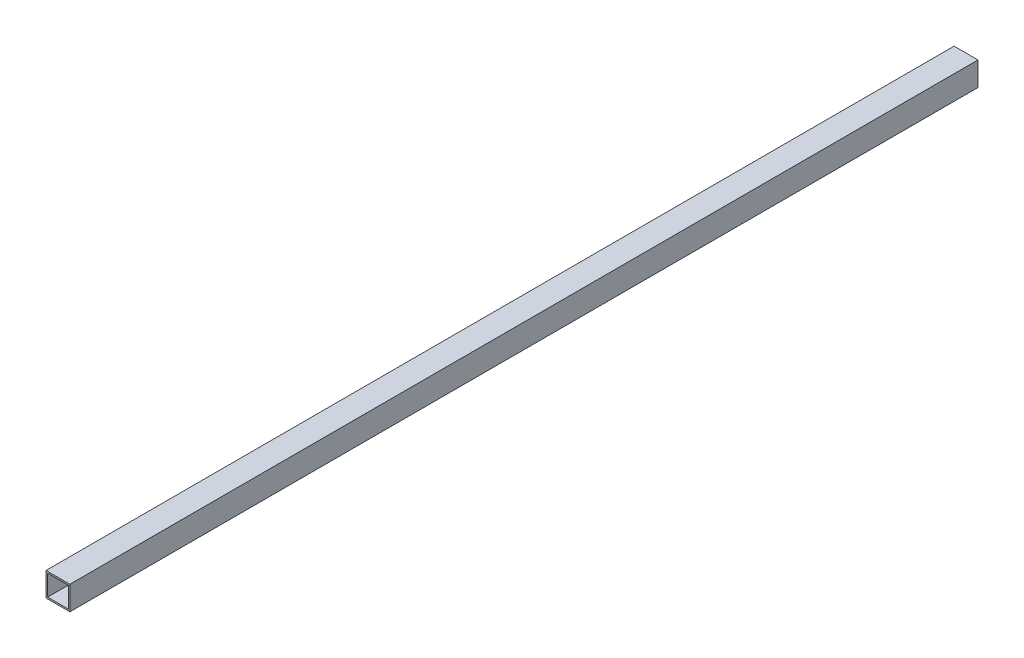
ISO-10303-21;
HEADER;
FILE_DESCRIPTION(('STEP AP214'),'2;1');
FILE_NAME('part.step','',(''),(''),'','','');
FILE_SCHEMA(('AUTOMOTIVE_DESIGN { 1 0 10303 214 1 1 1 1 }'));
ENDSEC;
DATA;
#1=APPLICATION_CONTEXT('core data for automotive mechanical design processes');
#2=APPLICATION_PROTOCOL_DEFINITION('international standard','automotive_design',2000,#1);
#3=PRODUCT_CONTEXT('',#1,'mechanical');
#4=PRODUCT('Part','Part','',(#3));
#5=PRODUCT_RELATED_PRODUCT_CATEGORY('part','',(#4));
#6=PRODUCT_DEFINITION_FORMATION('','',#4);
#7=PRODUCT_DEFINITION_CONTEXT('part definition',#1,'design');
#8=PRODUCT_DEFINITION('design','',#6,#7);
#9=PRODUCT_DEFINITION_SHAPE('','',#8);
#10=(LENGTH_UNIT() NAMED_UNIT(*) SI_UNIT(.MILLI.,.METRE.));
#11=(NAMED_UNIT(*) PLANE_ANGLE_UNIT() SI_UNIT($,.RADIAN.));
#12=(NAMED_UNIT(*) SI_UNIT($,.STERADIAN.) SOLID_ANGLE_UNIT());
#13=UNCERTAINTY_MEASURE_WITH_UNIT(LENGTH_MEASURE(1.E-05),#10,'distance_accuracy_value','');
#14=(GEOMETRIC_REPRESENTATION_CONTEXT(3) GLOBAL_UNCERTAINTY_ASSIGNED_CONTEXT((#13)) GLOBAL_UNIT_ASSIGNED_CONTEXT((#10,
#11,#12)) REPRESENTATION_CONTEXT('',''));
#15=CARTESIAN_POINT('',(0.,0.,0.));
#16=DIRECTION('',(0.,0.,1.));
#17=DIRECTION('',(1.,0.,0.));
#18=AXIS2_PLACEMENT_3D('',#15,#16,#17);
#19=CARTESIAN_POINT('',(-30.,30.,1140.));
#20=DIRECTION('',(1.,0.,0.));
#21=DIRECTION('',(0.,0.,-1.));
#22=AXIS2_PLACEMENT_3D('',#19,#20,#21);
#23=PLANE('',#22);
#24=DIRECTION('',(0.,0.,-1.));
#25=VECTOR('',#24,1.);
#26=CARTESIAN_POINT('',(-30.,-30.,1140.));
#27=LINE('',#26,#25);
#28=CARTESIAN_POINT('',(-30.,-30.,1140.));
#29=VERTEX_POINT('',#28);
#30=CARTESIAN_POINT('',(-30.,-30.,-1140.));
#31=VERTEX_POINT('',#30);
#32=EDGE_CURVE('E96',#29,#31,#27,.T.);
#33=ORIENTED_EDGE('',*,*,#32,.F.);
#34=DIRECTION('',(0.,-1.,0.));
#35=VECTOR('',#34,1.);
#36=CARTESIAN_POINT('',(-30.,30.,1140.));
#37=LINE('',#36,#35);
#38=CARTESIAN_POINT('',(-30.,30.,1140.));
#39=VERTEX_POINT('',#38);
#40=EDGE_CURVE('E85',#39,#29,#37,.T.);
#41=ORIENTED_EDGE('',*,*,#40,.F.);
#42=DIRECTION('',(0.,0.,-1.));
#43=VECTOR('',#42,1.);
#44=CARTESIAN_POINT('',(-30.,30.,1140.));
#45=LINE('',#44,#43);
#46=CARTESIAN_POINT('',(-30.,30.,-1140.));
#47=VERTEX_POINT('',#46);
#48=EDGE_CURVE('E101',#39,#47,#45,.T.);
#49=ORIENTED_EDGE('',*,*,#48,.T.);
#50=DIRECTION('',(0.,-1.,0.));
#51=VECTOR('',#50,1.);
#52=CARTESIAN_POINT('',(-30.,30.,-1140.));
#53=LINE('',#52,#51);
#54=EDGE_CURVE('E97',#47,#31,#53,.T.);
#55=ORIENTED_EDGE('',*,*,#54,.T.);
#56=EDGE_LOOP('',(#33,#41,#49,#55));
#57=FACE_BOUND('',#56,.T.);
#58=ADVANCED_FACE('F33',(#57),#23,.F.);
#59=CARTESIAN_POINT('',(-30.,-30.,1140.));
#60=DIRECTION('',(0.,1.,0.));
#61=DIRECTION('',(0.,0.,1.));
#62=AXIS2_PLACEMENT_3D('',#59,#60,#61);
#63=PLANE('',#62);
#64=DIRECTION('',(0.,0.,-1.));
#65=VECTOR('',#64,1.);
#66=CARTESIAN_POINT('',(30.,-30.,1140.));
#67=LINE('',#66,#65);
#68=CARTESIAN_POINT('',(30.,-30.,1140.));
#69=VERTEX_POINT('',#68);
#70=CARTESIAN_POINT('',(30.,-30.,-1140.));
#71=VERTEX_POINT('',#70);
#72=EDGE_CURVE('E100',#69,#71,#67,.T.);
#73=ORIENTED_EDGE('',*,*,#72,.F.);
#74=DIRECTION('',(1.,0.,0.));
#75=VECTOR('',#74,1.);
#76=CARTESIAN_POINT('',(-30.,-30.,1140.));
#77=LINE('',#76,#75);
#78=EDGE_CURVE('E82',#29,#69,#77,.T.);
#79=ORIENTED_EDGE('',*,*,#78,.F.);
#80=ORIENTED_EDGE('',*,*,#32,.T.);
#81=DIRECTION('',(1.,0.,0.));
#82=VECTOR('',#81,1.);
#83=CARTESIAN_POINT('',(-30.,-30.,-1140.));
#84=LINE('',#83,#82);
#85=EDGE_CURVE('E123',#31,#71,#84,.T.);
#86=ORIENTED_EDGE('',*,*,#85,.T.);
#87=EDGE_LOOP('',(#73,#79,#80,#86));
#88=FACE_BOUND('',#87,.T.);
#89=ADVANCED_FACE('F103',(#88),#63,.F.);
#90=CARTESIAN_POINT('',(30.,30.,1140.));
#91=DIRECTION('',(-1.,0.,0.));
#92=DIRECTION('',(0.,0.,1.));
#93=AXIS2_PLACEMENT_3D('',#90,#91,#92);
#94=PLANE('',#93);
#95=DIRECTION('',(0.,0.,-1.));
#96=VECTOR('',#95,1.);
#97=CARTESIAN_POINT('',(30.,30.,1140.));
#98=LINE('',#97,#96);
#99=CARTESIAN_POINT('',(30.,30.,1140.));
#100=VERTEX_POINT('',#99);
#101=CARTESIAN_POINT('',(30.,30.,-1140.));
#102=VERTEX_POINT('',#101);
#103=EDGE_CURVE('E37',#100,#102,#98,.T.);
#104=ORIENTED_EDGE('',*,*,#103,.F.);
#105=DIRECTION('',(0.,1.,0.));
#106=VECTOR('',#105,1.);
#107=CARTESIAN_POINT('',(30.,30.,1140.));
#108=LINE('',#107,#106);
#109=EDGE_CURVE('E106',#69,#100,#108,.T.);
#110=ORIENTED_EDGE('',*,*,#109,.F.);
#111=ORIENTED_EDGE('',*,*,#72,.T.);
#112=DIRECTION('',(0.,1.,0.));
#113=VECTOR('',#112,1.);
#114=CARTESIAN_POINT('',(30.,30.,-1140.));
#115=LINE('',#114,#113);
#116=EDGE_CURVE('E110',#71,#102,#115,.T.);
#117=ORIENTED_EDGE('',*,*,#116,.T.);
#118=EDGE_LOOP('',(#104,#110,#111,#117));
#119=FACE_BOUND('',#118,.T.);
#120=ADVANCED_FACE('F121',(#119),#94,.F.);
#121=CARTESIAN_POINT('',(-30.,30.,1140.));
#122=DIRECTION('',(0.,-1.,0.));
#123=DIRECTION('',(0.,0.,-1.));
#124=AXIS2_PLACEMENT_3D('',#121,#122,#123);
#125=PLANE('',#124);
#126=DIRECTION('',(-1.,0.,0.));
#127=VECTOR('',#126,1.);
#128=CARTESIAN_POINT('',(-30.,30.,-1140.));
#129=LINE('',#128,#127);
#130=EDGE_CURVE('E120',#102,#47,#129,.T.);
#131=ORIENTED_EDGE('',*,*,#130,.T.);
#132=ORIENTED_EDGE('',*,*,#48,.F.);
#133=DIRECTION('',(-1.,0.,0.));
#134=VECTOR('',#133,1.);
#135=CARTESIAN_POINT('',(-30.,30.,1140.));
#136=LINE('',#135,#134);
#137=EDGE_CURVE('E89',#100,#39,#136,.T.);
#138=ORIENTED_EDGE('',*,*,#137,.F.);
#139=ORIENTED_EDGE('',*,*,#103,.T.);
#140=EDGE_LOOP('',(#131,#132,#138,#139));
#141=FACE_BOUND('',#140,.T.);
#142=ADVANCED_FACE('F35',(#141),#125,.F.);
#143=CARTESIAN_POINT('',(0.,0.,1140.));
#144=DIRECTION('',(0.,0.,1.));
#145=DIRECTION('',(1.,0.,0.));
#146=AXIS2_PLACEMENT_3D('',#143,#144,#145);
#147=PLANE('',#146);
#148=DIRECTION('',(0.,-1.,0.));
#149=VECTOR('',#148,1.);
#150=CARTESIAN_POINT('',(-26.,26.,1140.));
#151=LINE('',#150,#149);
#152=CARTESIAN_POINT('',(-26.,-26.,1140.));
#153=VERTEX_POINT('',#152);
#154=CARTESIAN_POINT('',(-26.,26.,1140.));
#155=VERTEX_POINT('',#154);
#156=EDGE_CURVE('E128',#153,#155,#151,.F.);
#157=ORIENTED_EDGE('',*,*,#156,.T.);
#158=DIRECTION('',(-1.,0.,0.));
#159=VECTOR('',#158,1.);
#160=CARTESIAN_POINT('',(-26.,26.,1140.));
#161=LINE('',#160,#159);
#162=CARTESIAN_POINT('',(26.,26.,1140.));
#163=VERTEX_POINT('',#162);
#164=EDGE_CURVE('E124',#155,#163,#161,.F.);
#165=ORIENTED_EDGE('',*,*,#164,.T.);
#166=DIRECTION('',(0.,1.,0.));
#167=VECTOR('',#166,1.);
#168=CARTESIAN_POINT('',(26.,26.,1140.));
#169=LINE('',#168,#167);
#170=CARTESIAN_POINT('',(26.,-26.,1140.));
#171=VERTEX_POINT('',#170);
#172=EDGE_CURVE('E142',#163,#171,#169,.F.);
#173=ORIENTED_EDGE('',*,*,#172,.T.);
#174=DIRECTION('',(1.,0.,0.));
#175=VECTOR('',#174,1.);
#176=CARTESIAN_POINT('',(-26.,-26.,1140.));
#177=LINE('',#176,#175);
#178=EDGE_CURVE('E132',#171,#153,#177,.F.);
#179=ORIENTED_EDGE('',*,*,#178,.T.);
#180=EDGE_LOOP('',(#157,#165,#173,#179));
#181=FACE_BOUND('',#180,.T.);
#182=ORIENTED_EDGE('',*,*,#40,.T.);
#183=ORIENTED_EDGE('',*,*,#78,.T.);
#184=ORIENTED_EDGE('',*,*,#109,.T.);
#185=ORIENTED_EDGE('',*,*,#137,.T.);
#186=EDGE_LOOP('',(#182,#183,#184,#185));
#187=FACE_BOUND('',#186,.T.);
#188=ADVANCED_FACE('F87',(#181,#187),#147,.T.);
#189=CARTESIAN_POINT('',(0.,0.,-1140.));
#190=DIRECTION('',(0.,0.,1.));
#191=DIRECTION('',(1.,0.,0.));
#192=AXIS2_PLACEMENT_3D('',#189,#190,#191);
#193=PLANE('',#192);
#194=DIRECTION('',(0.,-1.,0.));
#195=VECTOR('',#194,1.);
#196=CARTESIAN_POINT('',(-26.,26.,-1140.));
#197=LINE('',#196,#195);
#198=CARTESIAN_POINT('',(-26.,-26.,-1140.));
#199=VERTEX_POINT('',#198);
#200=CARTESIAN_POINT('',(-26.,26.,-1140.));
#201=VERTEX_POINT('',#200);
#202=EDGE_CURVE('E11',#199,#201,#197,.F.);
#203=ORIENTED_EDGE('',*,*,#202,.F.);
#204=DIRECTION('',(1.,0.,0.));
#205=VECTOR('',#204,1.);
#206=CARTESIAN_POINT('',(-26.,-26.,-1140.));
#207=LINE('',#206,#205);
#208=CARTESIAN_POINT('',(26.,-26.,-1140.));
#209=VERTEX_POINT('',#208);
#210=EDGE_CURVE('E43',#209,#199,#207,.F.);
#211=ORIENTED_EDGE('',*,*,#210,.F.);
#212=DIRECTION('',(0.,1.,0.));
#213=VECTOR('',#212,1.);
#214=CARTESIAN_POINT('',(26.,26.,-1140.));
#215=LINE('',#214,#213);
#216=CARTESIAN_POINT('',(26.,26.,-1140.));
#217=VERTEX_POINT('',#216);
#218=EDGE_CURVE('E139',#217,#209,#215,.F.);
#219=ORIENTED_EDGE('',*,*,#218,.F.);
#220=DIRECTION('',(-1.,0.,0.));
#221=VECTOR('',#220,1.);
#222=CARTESIAN_POINT('',(-26.,26.,-1140.));
#223=LINE('',#222,#221);
#224=EDGE_CURVE('E136',#201,#217,#223,.F.);
#225=ORIENTED_EDGE('',*,*,#224,.F.);
#226=EDGE_LOOP('',(#203,#211,#219,#225));
#227=FACE_BOUND('',#226,.T.);
#228=ORIENTED_EDGE('',*,*,#54,.F.);
#229=ORIENTED_EDGE('',*,*,#130,.F.);
#230=ORIENTED_EDGE('',*,*,#116,.F.);
#231=ORIENTED_EDGE('',*,*,#85,.F.);
#232=EDGE_LOOP('',(#228,#229,#230,#231));
#233=FACE_BOUND('',#232,.T.);
#234=ADVANCED_FACE('F189',(#227,#233),#193,.F.);
#235=CARTESIAN_POINT('',(-26.,26.,1140.));
#236=DIRECTION('',(0.,1.,0.));
#237=DIRECTION('',(0.,0.,1.));
#238=AXIS2_PLACEMENT_3D('',#235,#236,#237);
#239=PLANE('',#238);
#240=DIRECTION('',(0.,0.,-1.));
#241=VECTOR('',#240,1.);
#242=CARTESIAN_POINT('',(26.,26.,1140.));
#243=LINE('',#242,#241);
#244=EDGE_CURVE('E144',#163,#217,#243,.T.);
#245=ORIENTED_EDGE('',*,*,#244,.F.);
#246=ORIENTED_EDGE('',*,*,#164,.F.);
#247=DIRECTION('',(0.,0.,-1.));
#248=VECTOR('',#247,1.);
#249=CARTESIAN_POINT('',(-26.,26.,1140.));
#250=LINE('',#249,#248);
#251=EDGE_CURVE('E131',#155,#201,#250,.T.);
#252=ORIENTED_EDGE('',*,*,#251,.T.);
#253=ORIENTED_EDGE('',*,*,#224,.T.);
#254=EDGE_LOOP('',(#245,#246,#252,#253));
#255=FACE_BOUND('',#254,.T.);
#256=ADVANCED_FACE('F166',(#255),#239,.F.);
#257=CARTESIAN_POINT('',(26.,26.,1140.));
#258=DIRECTION('',(1.,0.,0.));
#259=DIRECTION('',(0.,0.,-1.));
#260=AXIS2_PLACEMENT_3D('',#257,#258,#259);
#261=PLANE('',#260);
#262=DIRECTION('',(0.,0.,-1.));
#263=VECTOR('',#262,1.);
#264=CARTESIAN_POINT('',(26.,-26.,1140.));
#265=LINE('',#264,#263);
#266=EDGE_CURVE('E137',#171,#209,#265,.T.);
#267=ORIENTED_EDGE('',*,*,#266,.F.);
#268=ORIENTED_EDGE('',*,*,#172,.F.);
#269=ORIENTED_EDGE('',*,*,#244,.T.);
#270=ORIENTED_EDGE('',*,*,#218,.T.);
#271=EDGE_LOOP('',(#267,#268,#269,#270));
#272=FACE_BOUND('',#271,.T.);
#273=ADVANCED_FACE('F170',(#272),#261,.F.);
#274=CARTESIAN_POINT('',(-26.,-26.,1140.));
#275=DIRECTION('',(0.,-1.,0.));
#276=DIRECTION('',(0.,0.,-1.));
#277=AXIS2_PLACEMENT_3D('',#274,#275,#276);
#278=PLANE('',#277);
#279=DIRECTION('',(0.,0.,-1.));
#280=VECTOR('',#279,1.);
#281=CARTESIAN_POINT('',(-26.,-26.,1140.));
#282=LINE('',#281,#280);
#283=EDGE_CURVE('E133',#153,#199,#282,.T.);
#284=ORIENTED_EDGE('',*,*,#283,.F.);
#285=ORIENTED_EDGE('',*,*,#178,.F.);
#286=ORIENTED_EDGE('',*,*,#266,.T.);
#287=ORIENTED_EDGE('',*,*,#210,.T.);
#288=EDGE_LOOP('',(#284,#285,#286,#287));
#289=FACE_BOUND('',#288,.T.);
#290=ADVANCED_FACE('F178',(#289),#278,.F.);
#291=CARTESIAN_POINT('',(-26.,26.,1140.));
#292=DIRECTION('',(-1.,0.,0.));
#293=DIRECTION('',(0.,0.,1.));
#294=AXIS2_PLACEMENT_3D('',#291,#292,#293);
#295=PLANE('',#294);
#296=ORIENTED_EDGE('',*,*,#202,.T.);
#297=ORIENTED_EDGE('',*,*,#251,.F.);
#298=ORIENTED_EDGE('',*,*,#156,.F.);
#299=ORIENTED_EDGE('',*,*,#283,.T.);
#300=EDGE_LOOP('',(#296,#297,#298,#299));
#301=FACE_BOUND('',#300,.T.);
#302=ADVANCED_FACE('F177',(#301),#295,.F.);
#303=CLOSED_SHELL('',(#58,#89,#120,#142,#188,#234,#256,#273,#290,#302));
#304=MANIFOLD_SOLID_BREP('B2',#303);
#305=ADVANCED_BREP_SHAPE_REPRESENTATION('',(#18,#304),#14);
#306=SHAPE_DEFINITION_REPRESENTATION(#9,#305);
ENDSEC;
END-ISO-10303-21;
